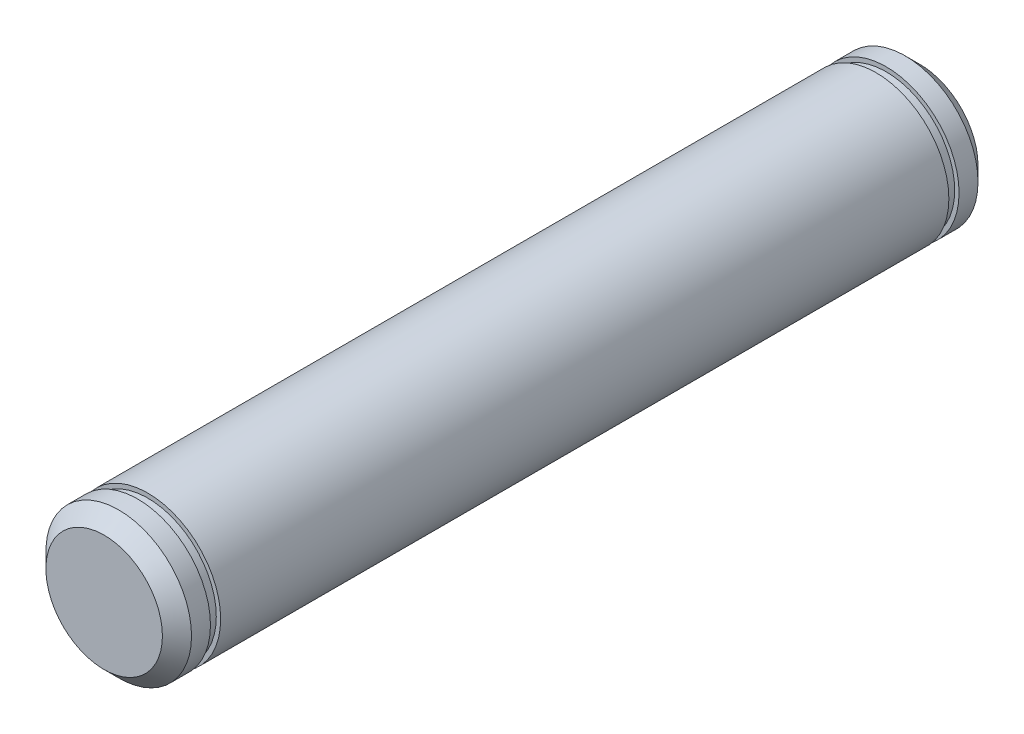
ISO-10303-21;
HEADER;
FILE_DESCRIPTION(('STEP AP214'),'2;1');
FILE_NAME('part.step','',(''),(''),'','','');
FILE_SCHEMA(('AUTOMOTIVE_DESIGN { 1 0 10303 214 1 1 1 1 }'));
ENDSEC;
DATA;
#1=APPLICATION_CONTEXT('core data for automotive mechanical design processes');
#2=APPLICATION_PROTOCOL_DEFINITION('international standard','automotive_design',2000,#1);
#3=PRODUCT_CONTEXT('',#1,'mechanical');
#4=PRODUCT('Part','Part','',(#3));
#5=PRODUCT_RELATED_PRODUCT_CATEGORY('part','',(#4));
#6=PRODUCT_DEFINITION_FORMATION('','',#4);
#7=PRODUCT_DEFINITION_CONTEXT('part definition',#1,'design');
#8=PRODUCT_DEFINITION('design','',#6,#7);
#9=PRODUCT_DEFINITION_SHAPE('','',#8);
#10=(LENGTH_UNIT() NAMED_UNIT(*) SI_UNIT(.MILLI.,.METRE.));
#11=(NAMED_UNIT(*) PLANE_ANGLE_UNIT() SI_UNIT($,.RADIAN.));
#12=(NAMED_UNIT(*) SI_UNIT($,.STERADIAN.) SOLID_ANGLE_UNIT());
#13=UNCERTAINTY_MEASURE_WITH_UNIT(LENGTH_MEASURE(1.E-05),#10,'distance_accuracy_value','');
#14=(GEOMETRIC_REPRESENTATION_CONTEXT(3) GLOBAL_UNCERTAINTY_ASSIGNED_CONTEXT((#13)) GLOBAL_UNIT_ASSIGNED_CONTEXT((#10,
#11,#12)) REPRESENTATION_CONTEXT('',''));
#15=CARTESIAN_POINT('',(0.,0.,0.));
#16=DIRECTION('',(0.,0.,1.));
#17=DIRECTION('',(1.,0.,0.));
#18=AXIS2_PLACEMENT_3D('',#15,#16,#17);
#19=CARTESIAN_POINT('',(0.,0.,-28.));
#20=DIRECTION('',(0.,0.,1.));
#21=DIRECTION('',(1.,0.,0.));
#22=AXIS2_PLACEMENT_3D('',#19,#20,#21);
#23=CYLINDRICAL_SURFACE('',#22,5.);
#24=CARTESIAN_POINT('',(0.,0.,27.));
#25=DIRECTION('',(0.,0.,1.));
#26=DIRECTION('',(1.,0.,0.));
#27=AXIS2_PLACEMENT_3D('',#24,#25,#26);
#28=CIRCLE('',#27,5.);
#29=CARTESIAN_POINT('',(5.,0.,27.));
#30=VERTEX_POINT('',#29);
#31=EDGE_CURVE('E11',#30,#30,#28,.F.);
#32=ORIENTED_EDGE('',*,*,#31,.T.);
#33=EDGE_LOOP('',(#32));
#34=FACE_BOUND('',#33,.T.);
#35=CARTESIAN_POINT('',(0.,0.,25.7));
#36=DIRECTION('',(0.,0.,1.));
#37=DIRECTION('',(1.,0.,0.));
#38=AXIS2_PLACEMENT_3D('',#35,#36,#37);
#39=CIRCLE('',#38,5.);
#40=CARTESIAN_POINT('',(5.,0.,25.7));
#41=VERTEX_POINT('',#40);
#42=EDGE_CURVE('E61',#41,#41,#39,.F.);
#43=ORIENTED_EDGE('',*,*,#42,.F.);
#44=EDGE_LOOP('',(#43));
#45=FACE_BOUND('',#44,.T.);
#46=ADVANCED_FACE('F41',(#34,#45),#23,.T.);
#47=CARTESIAN_POINT('',(0.,0.,28.));
#48=DIRECTION('',(0.,0.,1.));
#49=DIRECTION('',(1.,0.,0.));
#50=AXIS2_PLACEMENT_3D('',#47,#48,#49);
#51=PLANE('',#50);
#52=CARTESIAN_POINT('',(0.,0.,28.));
#53=DIRECTION('',(0.,0.,1.));
#54=DIRECTION('',(1.,0.,0.));
#55=AXIS2_PLACEMENT_3D('',#52,#53,#54);
#56=CIRCLE('',#55,4.);
#57=CARTESIAN_POINT('',(4.,0.,28.));
#58=VERTEX_POINT('',#57);
#59=EDGE_CURVE('E48',#58,#58,#56,.T.);
#60=ORIENTED_EDGE('',*,*,#59,.T.);
#61=EDGE_LOOP('',(#60));
#62=FACE_BOUND('',#61,.T.);
#63=ADVANCED_FACE('F108',(#62),#51,.T.);
#64=CARTESIAN_POINT('',(0.,0.,25.7));
#65=DIRECTION('',(0.,0.,1.));
#66=DIRECTION('',(1.,0.,0.));
#67=AXIS2_PLACEMENT_3D('',#64,#65,#66);
#68=PLANE('',#67);
#69=ORIENTED_EDGE('',*,*,#42,.T.);
#70=EDGE_LOOP('',(#69));
#71=FACE_BOUND('',#70,.T.);
#72=CARTESIAN_POINT('',(0.,0.,25.7));
#73=DIRECTION('',(0.,0.,1.));
#74=DIRECTION('',(1.,0.,0.));
#75=AXIS2_PLACEMENT_3D('',#72,#73,#74);
#76=CIRCLE('',#75,4.7);
#77=CARTESIAN_POINT('',(4.7,0.,25.7));
#78=VERTEX_POINT('',#77);
#79=EDGE_CURVE('E75',#78,#78,#76,.T.);
#80=ORIENTED_EDGE('',*,*,#79,.T.);
#81=EDGE_LOOP('',(#80));
#82=FACE_BOUND('',#81,.T.);
#83=ADVANCED_FACE('F113',(#71,#82),#68,.F.);
#84=CARTESIAN_POINT('',(0.,0.,25.));
#85=DIRECTION('',(0.,0.,1.));
#86=DIRECTION('',(1.,0.,0.));
#87=AXIS2_PLACEMENT_3D('',#84,#85,#86);
#88=PLANE('',#87);
#89=CARTESIAN_POINT('',(0.,0.,25.));
#90=DIRECTION('',(0.,0.,1.));
#91=DIRECTION('',(1.,0.,0.));
#92=AXIS2_PLACEMENT_3D('',#89,#90,#91);
#93=CIRCLE('',#92,5.);
#94=CARTESIAN_POINT('',(5.,0.,25.));
#95=VERTEX_POINT('',#94);
#96=EDGE_CURVE('E72',#95,#95,#93,.F.);
#97=ORIENTED_EDGE('',*,*,#96,.F.);
#98=EDGE_LOOP('',(#97));
#99=FACE_BOUND('',#98,.T.);
#100=CARTESIAN_POINT('',(0.,0.,25.));
#101=DIRECTION('',(0.,0.,1.));
#102=DIRECTION('',(1.,0.,0.));
#103=AXIS2_PLACEMENT_3D('',#100,#101,#102);
#104=CIRCLE('',#103,4.7);
#105=CARTESIAN_POINT('',(4.7,0.,25.));
#106=VERTEX_POINT('',#105);
#107=EDGE_CURVE('E65',#106,#106,#104,.T.);
#108=ORIENTED_EDGE('',*,*,#107,.F.);
#109=EDGE_LOOP('',(#108));
#110=FACE_BOUND('',#109,.T.);
#111=ADVANCED_FACE('F135',(#99,#110),#88,.T.);
#112=CARTESIAN_POINT('',(0.,0.,25.7));
#113=DIRECTION('',(0.,0.,-1.));
#114=DIRECTION('',(-1.,0.,0.));
#115=AXIS2_PLACEMENT_3D('',#112,#113,#114);
#116=CYLINDRICAL_SURFACE('',#115,4.7);
#117=ORIENTED_EDGE('',*,*,#79,.F.);
#118=EDGE_LOOP('',(#117));
#119=FACE_BOUND('',#118,.T.);
#120=ORIENTED_EDGE('',*,*,#107,.T.);
#121=EDGE_LOOP('',(#120));
#122=FACE_BOUND('',#121,.T.);
#123=ADVANCED_FACE('F101',(#119,#122),#116,.T.);
#124=CARTESIAN_POINT('',(0.,0.,-25.));
#125=DIRECTION('',(0.,0.,1.));
#126=DIRECTION('',(1.,0.,0.));
#127=AXIS2_PLACEMENT_3D('',#124,#125,#126);
#128=CIRCLE('',#127,5.);
#129=CARTESIAN_POINT('',(5.,0.,-25.));
#130=VERTEX_POINT('',#129);
#131=EDGE_CURVE('E66',#130,#130,#128,.F.);
#132=ORIENTED_EDGE('',*,*,#131,.F.);
#133=EDGE_LOOP('',(#132));
#134=FACE_BOUND('',#133,.T.);
#135=ORIENTED_EDGE('',*,*,#96,.T.);
#136=EDGE_LOOP('',(#135));
#137=FACE_BOUND('',#136,.T.);
#138=ADVANCED_FACE('F92',(#134,#137),#23,.T.);
#139=CARTESIAN_POINT('',(0.,0.,-25.7));
#140=DIRECTION('',(0.,0.,1.));
#141=DIRECTION('',(1.,0.,0.));
#142=AXIS2_PLACEMENT_3D('',#139,#140,#141);
#143=PLANE('',#142);
#144=CARTESIAN_POINT('',(0.,0.,-25.7));
#145=DIRECTION('',(0.,0.,1.));
#146=DIRECTION('',(1.,0.,0.));
#147=AXIS2_PLACEMENT_3D('',#144,#145,#146);
#148=CIRCLE('',#147,5.);
#149=CARTESIAN_POINT('',(5.,0.,-25.7));
#150=VERTEX_POINT('',#149);
#151=EDGE_CURVE('E62',#150,#150,#148,.F.);
#152=ORIENTED_EDGE('',*,*,#151,.F.);
#153=EDGE_LOOP('',(#152));
#154=FACE_BOUND('',#153,.T.);
#155=CARTESIAN_POINT('',(0.,0.,-25.7));
#156=DIRECTION('',(0.,0.,1.));
#157=DIRECTION('',(1.,0.,0.));
#158=AXIS2_PLACEMENT_3D('',#155,#156,#157);
#159=CIRCLE('',#158,4.7);
#160=CARTESIAN_POINT('',(4.7,0.,-25.7));
#161=VERTEX_POINT('',#160);
#162=EDGE_CURVE('E69',#161,#161,#159,.T.);
#163=ORIENTED_EDGE('',*,*,#162,.F.);
#164=EDGE_LOOP('',(#163));
#165=FACE_BOUND('',#164,.T.);
#166=ADVANCED_FACE('F89',(#154,#165),#143,.T.);
#167=CARTESIAN_POINT('',(0.,0.,-25.));
#168=DIRECTION('',(0.,0.,1.));
#169=DIRECTION('',(1.,0.,0.));
#170=AXIS2_PLACEMENT_3D('',#167,#168,#169);
#171=PLANE('',#170);
#172=ORIENTED_EDGE('',*,*,#131,.T.);
#173=EDGE_LOOP('',(#172));
#174=FACE_BOUND('',#173,.T.);
#175=CARTESIAN_POINT('',(0.,0.,-25.));
#176=DIRECTION('',(0.,0.,1.));
#177=DIRECTION('',(1.,0.,0.));
#178=AXIS2_PLACEMENT_3D('',#175,#176,#177);
#179=CIRCLE('',#178,4.7);
#180=CARTESIAN_POINT('',(4.7,0.,-25.));
#181=VERTEX_POINT('',#180);
#182=EDGE_CURVE('E80',#181,#181,#179,.T.);
#183=ORIENTED_EDGE('',*,*,#182,.T.);
#184=EDGE_LOOP('',(#183));
#185=FACE_BOUND('',#184,.T.);
#186=ADVANCED_FACE('F91',(#174,#185),#171,.F.);
#187=CARTESIAN_POINT('',(0.,0.,-25.7));
#188=DIRECTION('',(0.,0.,1.));
#189=DIRECTION('',(1.,0.,0.));
#190=AXIS2_PLACEMENT_3D('',#187,#188,#189);
#191=CYLINDRICAL_SURFACE('',#190,4.7);
#192=ORIENTED_EDGE('',*,*,#162,.T.);
#193=EDGE_LOOP('',(#192));
#194=FACE_BOUND('',#193,.T.);
#195=ORIENTED_EDGE('',*,*,#182,.F.);
#196=EDGE_LOOP('',(#195));
#197=FACE_BOUND('',#196,.T.);
#198=ADVANCED_FACE('F86',(#194,#197),#191,.T.);
#199=CARTESIAN_POINT('',(0.,0.,-28.));
#200=DIRECTION('',(0.,0.,1.));
#201=DIRECTION('',(1.,0.,0.));
#202=AXIS2_PLACEMENT_3D('',#199,#200,#201);
#203=PLANE('',#202);
#204=CARTESIAN_POINT('',(0.,0.,-28.));
#205=DIRECTION('',(0.,0.,1.));
#206=DIRECTION('',(1.,0.,0.));
#207=AXIS2_PLACEMENT_3D('',#204,#205,#206);
#208=CIRCLE('',#207,3.99999999999998);
#209=CARTESIAN_POINT('',(3.99999999999998,0.,-28.));
#210=VERTEX_POINT('',#209);
#211=EDGE_CURVE('E52',#210,#210,#208,.F.);
#212=ORIENTED_EDGE('',*,*,#211,.T.);
#213=EDGE_LOOP('',(#212));
#214=FACE_BOUND('',#213,.T.);
#215=ADVANCED_FACE('F119',(#214),#203,.F.);
#216=CARTESIAN_POINT('',(0.,0.,-27.));
#217=DIRECTION('',(0.,0.,1.));
#218=DIRECTION('',(1.,0.,0.));
#219=AXIS2_PLACEMENT_3D('',#216,#217,#218);
#220=CIRCLE('',#219,5.);
#221=CARTESIAN_POINT('',(5.,0.,-27.));
#222=VERTEX_POINT('',#221);
#223=EDGE_CURVE('E56',#222,#222,#220,.T.);
#224=ORIENTED_EDGE('',*,*,#223,.T.);
#225=EDGE_LOOP('',(#224));
#226=FACE_BOUND('',#225,.T.);
#227=ORIENTED_EDGE('',*,*,#151,.T.);
#228=EDGE_LOOP('',(#227));
#229=FACE_BOUND('',#228,.T.);
#230=ADVANCED_FACE('F104',(#226,#229),#23,.T.);
#231=CARTESIAN_POINT('',(0.,0.,-27.));
#232=DIRECTION('',(0.,0.,1.));
#233=DIRECTION('',(1.,0.,0.));
#234=AXIS2_PLACEMENT_3D('',#231,#232,#233);
#235=CONICAL_SURFACE('',#234,5.,0.78539816339745);
#236=ORIENTED_EDGE('',*,*,#211,.F.);
#237=EDGE_LOOP('',(#236));
#238=FACE_BOUND('',#237,.T.);
#239=ORIENTED_EDGE('',*,*,#223,.F.);
#240=EDGE_LOOP('',(#239));
#241=FACE_BOUND('',#240,.T.);
#242=ADVANCED_FACE('F118',(#238,#241),#235,.T.);
#243=CARTESIAN_POINT('',(0.,0.,28.));
#244=DIRECTION('',(0.,0.,-1.));
#245=DIRECTION('',(-1.,0.,0.));
#246=AXIS2_PLACEMENT_3D('',#243,#244,#245);
#247=CONICAL_SURFACE('',#246,4.,0.785398163397448);
#248=ORIENTED_EDGE('',*,*,#31,.F.);
#249=EDGE_LOOP('',(#248));
#250=FACE_BOUND('',#249,.T.);
#251=ORIENTED_EDGE('',*,*,#59,.F.);
#252=EDGE_LOOP('',(#251));
#253=FACE_BOUND('',#252,.T.);
#254=ADVANCED_FACE('F43',(#250,#253),#247,.T.);
#255=CLOSED_SHELL('',(#46,#63,#83,#111,#123,#138,#166,#186,#198,#215,#230,#242,#254));
#256=MANIFOLD_SOLID_BREP('B2',#255);
#257=ADVANCED_BREP_SHAPE_REPRESENTATION('',(#18,#256),#14);
#258=SHAPE_DEFINITION_REPRESENTATION(#9,#257);
ENDSEC;
END-ISO-10303-21;
